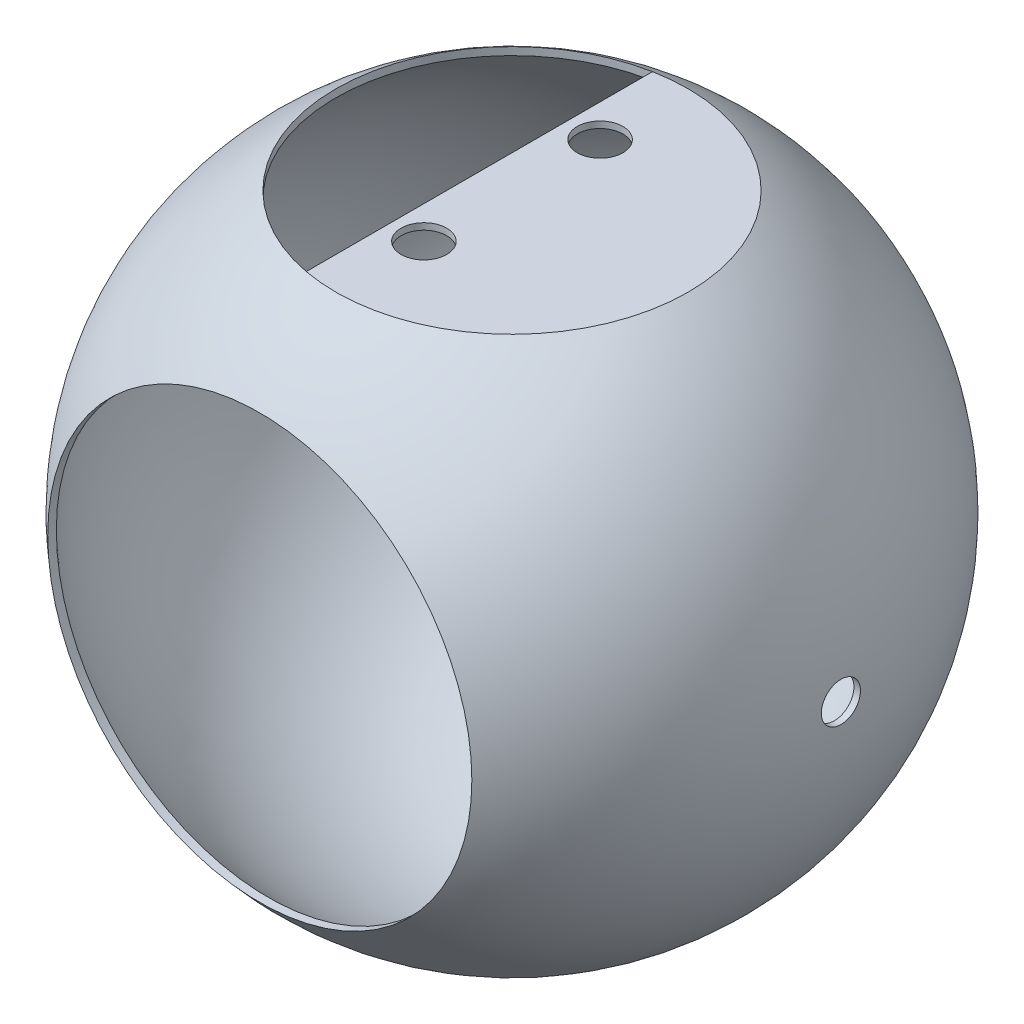
ISO-10303-21;
HEADER;
FILE_DESCRIPTION(('STEP AP214'),'2;1');
FILE_NAME('part.step','',(''),(''),'','','');
FILE_SCHEMA(('AUTOMOTIVE_DESIGN { 1 0 10303 214 1 1 1 1 }'));
ENDSEC;
DATA;
#1=APPLICATION_CONTEXT('core data for automotive mechanical design processes');
#2=APPLICATION_PROTOCOL_DEFINITION('international standard','automotive_design',2000,#1);
#3=PRODUCT_CONTEXT('',#1,'mechanical');
#4=PRODUCT('Part','Part','',(#3));
#5=PRODUCT_RELATED_PRODUCT_CATEGORY('part','',(#4));
#6=PRODUCT_DEFINITION_FORMATION('','',#4);
#7=PRODUCT_DEFINITION_CONTEXT('part definition',#1,'design');
#8=PRODUCT_DEFINITION('design','',#6,#7);
#9=PRODUCT_DEFINITION_SHAPE('','',#8);
#10=(LENGTH_UNIT() NAMED_UNIT(*) SI_UNIT(.MILLI.,.METRE.));
#11=(NAMED_UNIT(*) PLANE_ANGLE_UNIT() SI_UNIT($,.RADIAN.));
#12=(NAMED_UNIT(*) SI_UNIT($,.STERADIAN.) SOLID_ANGLE_UNIT());
#13=UNCERTAINTY_MEASURE_WITH_UNIT(LENGTH_MEASURE(1.E-05),#10,'distance_accuracy_value','');
#14=(GEOMETRIC_REPRESENTATION_CONTEXT(3) GLOBAL_UNCERTAINTY_ASSIGNED_CONTEXT((#13)) GLOBAL_UNIT_ASSIGNED_CONTEXT((#10,
#11,#12)) REPRESENTATION_CONTEXT('',''));
#15=CARTESIAN_POINT('',(0.,0.,0.));
#16=DIRECTION('',(0.,0.,1.));
#17=DIRECTION('',(1.,0.,0.));
#18=AXIS2_PLACEMENT_3D('',#15,#16,#17);
#19=CARTESIAN_POINT('',(0.,0.,0.));
#20=DIRECTION('',(0.,0.,1.));
#21=DIRECTION('',(-1.,0.,0.));
#22=AXIS2_PLACEMENT_3D('',#19,#20,#21);
#23=SPHERICAL_SURFACE('',#22,99.);
#24=CARTESIAN_POINT('',(0.,82.975900115636,0.));
#25=DIRECTION('',(0.,-1.,0.));
#26=DIRECTION('',(0.,0.,-1.));
#27=AXIS2_PLACEMENT_3D('',#24,#25,#26);
#28=CIRCLE('',#27,54.);
#29=CARTESIAN_POINT('',(0.,82.975900115636,-54.));
#30=VERTEX_POINT('',#29);
#31=EDGE_CURVE('E11',#30,#30,#28,.T.);
#32=ORIENTED_EDGE('',*,*,#31,.F.);
#33=EDGE_LOOP('',(#32));
#34=FACE_BOUND('',#33,.T.);
#35=CARTESIAN_POINT('',(0.,0.,74.6726188103779));
#36=DIRECTION('',(0.,0.,-1.));
#37=DIRECTION('',(-1.,0.,0.));
#38=AXIS2_PLACEMENT_3D('',#35,#36,#37);
#39=CIRCLE('',#38,65.);
#40=CARTESIAN_POINT('',(-65.,0.,74.6726188103779));
#41=VERTEX_POINT('',#40);
#42=EDGE_CURVE('E72',#41,#41,#39,.T.);
#43=ORIENTED_EDGE('',*,*,#42,.F.);
#44=EDGE_LOOP('',(#43));
#45=FACE_BOUND('',#44,.T.);
#46=CARTESIAN_POINT('',(98.8180145520036,0.,0.));
#47=DIRECTION('',(-1.,0.,0.));
#48=DIRECTION('',(0.,0.,1.));
#49=AXIS2_PLACEMENT_3D('',#46,#47,#48);
#50=CIRCLE('',#49,6.);
#51=CARTESIAN_POINT('',(98.8180145520036,0.,6.));
#52=VERTEX_POINT('',#51);
#53=EDGE_CURVE('E89',#52,#52,#50,.T.);
#54=ORIENTED_EDGE('',*,*,#53,.F.);
#55=EDGE_LOOP('',(#54));
#56=FACE_BOUND('',#55,.T.);
#57=CARTESIAN_POINT('',(-98.8180145520036,0.,0.));
#58=DIRECTION('',(1.,0.,0.));
#59=DIRECTION('',(0.,0.,-1.));
#60=AXIS2_PLACEMENT_3D('',#57,#58,#59);
#61=CIRCLE('',#60,6.);
#62=CARTESIAN_POINT('',(-98.8180145520036,0.,-6.));
#63=VERTEX_POINT('',#62);
#64=EDGE_CURVE('E86',#63,#63,#61,.T.);
#65=ORIENTED_EDGE('',*,*,#64,.F.);
#66=EDGE_LOOP('',(#65));
#67=FACE_BOUND('',#66,.T.);
#68=ADVANCED_FACE('F38',(#34,#45,#56,#67),#23,.F.);
#69=CARTESIAN_POINT('',(0.,0.,0.));
#70=DIRECTION('',(0.,0.,1.));
#71=DIRECTION('',(-1.,0.,0.));
#72=AXIS2_PLACEMENT_3D('',#69,#70,#71);
#73=SPHERICAL_SURFACE('',#72,101.);
#74=CARTESIAN_POINT('',(100.821624664553,0.,0.));
#75=DIRECTION('',(-1.,0.,0.));
#76=DIRECTION('',(0.,0.,1.));
#77=AXIS2_PLACEMENT_3D('',#74,#75,#76);
#78=CIRCLE('',#77,6.);
#79=CARTESIAN_POINT('',(100.821624664553,0.,6.));
#80=VERTEX_POINT('',#79);
#81=EDGE_CURVE('E99',#80,#80,#78,.T.);
#82=ORIENTED_EDGE('',*,*,#81,.T.);
#83=EDGE_LOOP('',(#82));
#84=FACE_BOUND('',#83,.T.);
#85=CARTESIAN_POINT('',(0.,85.3522114534826,0.));
#86=DIRECTION('',(0.,-1.,0.));
#87=DIRECTION('',(0.,0.,-1.));
#88=AXIS2_PLACEMENT_3D('',#85,#86,#87);
#89=CIRCLE('',#88,54.);
#90=CARTESIAN_POINT('',(-10.,85.3522114534826,-53.0659966456864));
#91=VERTEX_POINT('',#90);
#92=CARTESIAN_POINT('',(-10.,85.3522114534826,53.0659966456864));
#93=VERTEX_POINT('',#92);
#94=EDGE_CURVE('E47',#91,#93,#89,.F.);
#95=ORIENTED_EDGE('',*,*,#94,.F.);
#96=CARTESIAN_POINT('',(0.,85.3522114534826,0.));
#97=DIRECTION('',(0.,-1.,0.));
#98=DIRECTION('',(0.,0.,-1.));
#99=AXIS2_PLACEMENT_3D('',#96,#97,#98);
#100=CIRCLE('',#99,54.);
#101=EDGE_CURVE('E70',#91,#93,#100,.T.);
#102=ORIENTED_EDGE('',*,*,#101,.T.);
#103=EDGE_LOOP('',(#95,#102));
#104=FACE_BOUND('',#103,.T.);
#105=CARTESIAN_POINT('',(0.,0.,77.3045923603508));
#106=DIRECTION('',(0.,0.,-1.));
#107=DIRECTION('',(-1.,0.,0.));
#108=AXIS2_PLACEMENT_3D('',#105,#106,#107);
#109=CIRCLE('',#108,65.);
#110=CARTESIAN_POINT('',(-65.,0.,77.3045923603508));
#111=VERTEX_POINT('',#110);
#112=EDGE_CURVE('E95',#111,#111,#109,.F.);
#113=ORIENTED_EDGE('',*,*,#112,.F.);
#114=EDGE_LOOP('',(#113));
#115=FACE_BOUND('',#114,.T.);
#116=CARTESIAN_POINT('',(-100.821624664553,0.,0.));
#117=DIRECTION('',(1.,0.,0.));
#118=DIRECTION('',(0.,0.,-1.));
#119=AXIS2_PLACEMENT_3D('',#116,#117,#118);
#120=CIRCLE('',#119,6.);
#121=CARTESIAN_POINT('',(-100.821624664553,0.,-6.));
#122=VERTEX_POINT('',#121);
#123=EDGE_CURVE('E42',#122,#122,#120,.T.);
#124=ORIENTED_EDGE('',*,*,#123,.T.);
#125=EDGE_LOOP('',(#124));
#126=FACE_BOUND('',#125,.T.);
#127=ADVANCED_FACE('F40',(#84,#104,#115,#126),#73,.T.);
#128=CARTESIAN_POINT('',(0.,101.001,0.));
#129=DIRECTION('',(0.,-1.,0.));
#130=DIRECTION('',(0.,0.,-1.));
#131=AXIS2_PLACEMENT_3D('',#128,#129,#130);
#132=CYLINDRICAL_SURFACE('',#131,54.);
#133=ORIENTED_EDGE('',*,*,#31,.T.);
#134=EDGE_LOOP('',(#133));
#135=FACE_BOUND('',#134,.T.);
#136=ORIENTED_EDGE('',*,*,#94,.T.);
#137=DIRECTION('',(0.,1.,0.));
#138=VECTOR('',#137,1.);
#139=CARTESIAN_POINT('',(-10.,83.3522114534826,53.0659966456864));
#140=LINE('',#139,#138);
#141=CARTESIAN_POINT('',(-10.,83.3522114534826,53.0659966456864));
#142=VERTEX_POINT('',#141);
#143=EDGE_CURVE('E55',#142,#93,#140,.T.);
#144=ORIENTED_EDGE('',*,*,#143,.F.);
#145=CARTESIAN_POINT('',(0.,83.3522114534826,0.));
#146=DIRECTION('',(0.,-1.,0.));
#147=DIRECTION('',(0.,0.,-1.));
#148=AXIS2_PLACEMENT_3D('',#145,#146,#147);
#149=CIRCLE('',#148,54.);
#150=CARTESIAN_POINT('',(-10.,83.3522114534826,-53.0659966456864));
#151=VERTEX_POINT('',#150);
#152=EDGE_CURVE('E60',#151,#142,#149,.T.);
#153=ORIENTED_EDGE('',*,*,#152,.F.);
#154=DIRECTION('',(0.,1.,0.));
#155=VECTOR('',#154,1.);
#156=CARTESIAN_POINT('',(-10.,83.3522114534826,-53.0659966456864));
#157=LINE('',#156,#155);
#158=EDGE_CURVE('E75',#151,#91,#157,.T.);
#159=ORIENTED_EDGE('',*,*,#158,.T.);
#160=EDGE_LOOP('',(#136,#144,#153,#159));
#161=FACE_BOUND('',#160,.T.);
#162=ADVANCED_FACE('F77',(#135,#161),#132,.F.);
#163=CARTESIAN_POINT('',(0.,0.,101.001));
#164=DIRECTION('',(0.,0.,-1.));
#165=DIRECTION('',(-1.,0.,0.));
#166=AXIS2_PLACEMENT_3D('',#163,#164,#165);
#167=CYLINDRICAL_SURFACE('',#166,65.);
#168=ORIENTED_EDGE('',*,*,#112,.T.);
#169=EDGE_LOOP('',(#168));
#170=FACE_BOUND('',#169,.T.);
#171=ORIENTED_EDGE('',*,*,#42,.T.);
#172=EDGE_LOOP('',(#171));
#173=FACE_BOUND('',#172,.T.);
#174=ADVANCED_FACE('F128',(#170,#173),#167,.F.);
#175=CARTESIAN_POINT('',(-10.,83.3522114534826,53.0659966456864));
#176=DIRECTION('',(1.,0.,0.));
#177=DIRECTION('',(0.,0.,-1.));
#178=AXIS2_PLACEMENT_3D('',#175,#176,#177);
#179=PLANE('',#178);
#180=DIRECTION('',(0.,0.,-1.));
#181=VECTOR('',#180,1.);
#182=CARTESIAN_POINT('',(-10.,85.3522114534826,53.0659966456864));
#183=LINE('',#182,#181);
#184=EDGE_CURVE('E81',#93,#91,#183,.T.);
#185=ORIENTED_EDGE('',*,*,#184,.T.);
#186=ORIENTED_EDGE('',*,*,#158,.F.);
#187=DIRECTION('',(0.,0.,-1.));
#188=VECTOR('',#187,1.);
#189=CARTESIAN_POINT('',(-10.,83.3522114534826,53.0659966456864));
#190=LINE('',#189,#188);
#191=EDGE_CURVE('E79',#142,#151,#190,.T.);
#192=ORIENTED_EDGE('',*,*,#191,.F.);
#193=ORIENTED_EDGE('',*,*,#143,.T.);
#194=EDGE_LOOP('',(#185,#186,#192,#193));
#195=FACE_BOUND('',#194,.T.);
#196=ADVANCED_FACE('F82',(#195),#179,.F.);
#197=CARTESIAN_POINT('',(0.,83.3522114534826,0.));
#198=DIRECTION('',(0.,-1.,0.));
#199=DIRECTION('',(0.,0.,-1.));
#200=AXIS2_PLACEMENT_3D('',#197,#198,#199);
#201=PLANE('',#200);
#202=CARTESIAN_POINT('',(0.,83.3522114534826,-27.));
#203=DIRECTION('',(0.,-1.,0.));
#204=DIRECTION('',(0.,0.,-1.));
#205=AXIS2_PLACEMENT_3D('',#202,#203,#204);
#206=CIRCLE('',#205,7.);
#207=CARTESIAN_POINT('',(0.,83.3522114534826,-34.));
#208=VERTEX_POINT('',#207);
#209=EDGE_CURVE('E101',#208,#208,#206,.T.);
#210=ORIENTED_EDGE('',*,*,#209,.F.);
#211=EDGE_LOOP('',(#210));
#212=FACE_BOUND('',#211,.T.);
#213=CARTESIAN_POINT('',(0.,83.3522114534826,27.));
#214=DIRECTION('',(0.,-1.,0.));
#215=DIRECTION('',(0.,0.,-1.));
#216=AXIS2_PLACEMENT_3D('',#213,#214,#215);
#217=CIRCLE('',#216,7.);
#218=CARTESIAN_POINT('',(0.,83.3522114534826,20.));
#219=VERTEX_POINT('',#218);
#220=EDGE_CURVE('E106',#219,#219,#217,.T.);
#221=ORIENTED_EDGE('',*,*,#220,.F.);
#222=EDGE_LOOP('',(#221));
#223=FACE_BOUND('',#222,.T.);
#224=ORIENTED_EDGE('',*,*,#152,.T.);
#225=ORIENTED_EDGE('',*,*,#191,.T.);
#226=EDGE_LOOP('',(#224,#225));
#227=FACE_BOUND('',#226,.T.);
#228=ADVANCED_FACE('F117',(#212,#223,#227),#201,.T.);
#229=CARTESIAN_POINT('',(0.,85.3522114534826,0.));
#230=DIRECTION('',(0.,-1.,0.));
#231=DIRECTION('',(0.,0.,-1.));
#232=AXIS2_PLACEMENT_3D('',#229,#230,#231);
#233=PLANE('',#232);
#234=CARTESIAN_POINT('',(0.,85.3522114534826,-27.));
#235=DIRECTION('',(0.,1.,0.));
#236=DIRECTION('',(0.,0.,1.));
#237=AXIS2_PLACEMENT_3D('',#234,#235,#236);
#238=CIRCLE('',#237,7.);
#239=CARTESIAN_POINT('',(0.,85.3522114534826,-20.));
#240=VERTEX_POINT('',#239);
#241=EDGE_CURVE('E111',#240,#240,#238,.T.);
#242=ORIENTED_EDGE('',*,*,#241,.F.);
#243=EDGE_LOOP('',(#242));
#244=FACE_BOUND('',#243,.T.);
#245=CARTESIAN_POINT('',(0.,85.3522114534826,27.));
#246=DIRECTION('',(0.,1.,0.));
#247=DIRECTION('',(0.,0.,1.));
#248=AXIS2_PLACEMENT_3D('',#245,#246,#247);
#249=CIRCLE('',#248,7.);
#250=CARTESIAN_POINT('',(0.,85.3522114534826,34.));
#251=VERTEX_POINT('',#250);
#252=EDGE_CURVE('E175',#251,#251,#249,.T.);
#253=ORIENTED_EDGE('',*,*,#252,.F.);
#254=EDGE_LOOP('',(#253));
#255=FACE_BOUND('',#254,.T.);
#256=ORIENTED_EDGE('',*,*,#101,.F.);
#257=ORIENTED_EDGE('',*,*,#184,.F.);
#258=EDGE_LOOP('',(#256,#257));
#259=FACE_BOUND('',#258,.T.);
#260=ADVANCED_FACE('F85',(#244,#255,#259),#233,.F.);
#261=CARTESIAN_POINT('',(200.,0.,0.));
#262=DIRECTION('',(-1.,0.,0.));
#263=DIRECTION('',(0.,0.,1.));
#264=AXIS2_PLACEMENT_3D('',#261,#262,#263);
#265=CYLINDRICAL_SURFACE('',#264,6.);
#266=ORIENTED_EDGE('',*,*,#81,.F.);
#267=EDGE_LOOP('',(#266));
#268=FACE_BOUND('',#267,.T.);
#269=ORIENTED_EDGE('',*,*,#53,.T.);
#270=EDGE_LOOP('',(#269));
#271=FACE_BOUND('',#270,.T.);
#272=ADVANCED_FACE('F125',(#268,#271),#265,.F.);
#273=ORIENTED_EDGE('',*,*,#123,.F.);
#274=EDGE_LOOP('',(#273));
#275=FACE_BOUND('',#274,.T.);
#276=ORIENTED_EDGE('',*,*,#64,.T.);
#277=EDGE_LOOP('',(#276));
#278=FACE_BOUND('',#277,.T.);
#279=ADVANCED_FACE('F155',(#275,#278),#265,.F.);
#280=CARTESIAN_POINT('',(0.,65.3522114534826,27.));
#281=DIRECTION('',(0.,1.,0.));
#282=DIRECTION('',(0.,0.,1.));
#283=AXIS2_PLACEMENT_3D('',#280,#281,#282);
#284=CYLINDRICAL_SURFACE('',#283,7.);
#285=ORIENTED_EDGE('',*,*,#220,.T.);
#286=EDGE_LOOP('',(#285));
#287=FACE_BOUND('',#286,.T.);
#288=ORIENTED_EDGE('',*,*,#252,.T.);
#289=EDGE_LOOP('',(#288));
#290=FACE_BOUND('',#289,.T.);
#291=ADVANCED_FACE('F157',(#287,#290),#284,.F.);
#292=CARTESIAN_POINT('',(0.,65.3522114534826,-27.));
#293=DIRECTION('',(0.,1.,0.));
#294=DIRECTION('',(0.,0.,1.));
#295=AXIS2_PLACEMENT_3D('',#292,#293,#294);
#296=CYLINDRICAL_SURFACE('',#295,7.);
#297=ORIENTED_EDGE('',*,*,#209,.T.);
#298=EDGE_LOOP('',(#297));
#299=FACE_BOUND('',#298,.T.);
#300=ORIENTED_EDGE('',*,*,#241,.T.);
#301=EDGE_LOOP('',(#300));
#302=FACE_BOUND('',#301,.T.);
#303=ADVANCED_FACE('F163',(#299,#302),#296,.F.);
#304=CLOSED_SHELL('',(#68,#127,#162,#174,#196,#228,#260,#272,#279,#291,#303));
#305=MANIFOLD_SOLID_BREP('B2',#304);
#306=ADVANCED_BREP_SHAPE_REPRESENTATION('',(#18,#305),#14);
#307=SHAPE_DEFINITION_REPRESENTATION(#9,#306);
ENDSEC;
END-ISO-10303-21;
